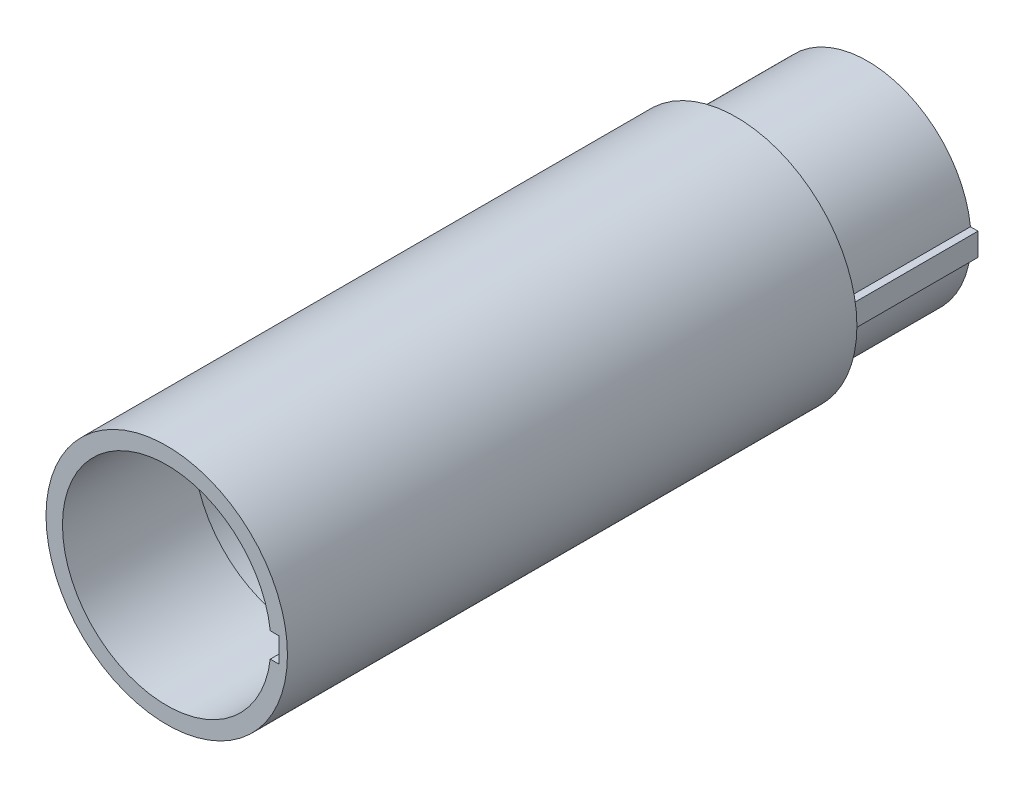
ISO-10303-21;
HEADER;
FILE_DESCRIPTION(('STEP AP214'),'2;1');
FILE_NAME('part.step','',(''),(''),'','','');
FILE_SCHEMA(('AUTOMOTIVE_DESIGN { 1 0 10303 214 1 1 1 1 }'));
ENDSEC;
DATA;
#1=APPLICATION_CONTEXT('core data for automotive mechanical design processes');
#2=APPLICATION_PROTOCOL_DEFINITION('international standard','automotive_design',2000,#1);
#3=PRODUCT_CONTEXT('',#1,'mechanical');
#4=PRODUCT('Part','Part','',(#3));
#5=PRODUCT_RELATED_PRODUCT_CATEGORY('part','',(#4));
#6=PRODUCT_DEFINITION_FORMATION('','',#4);
#7=PRODUCT_DEFINITION_CONTEXT('part definition',#1,'design');
#8=PRODUCT_DEFINITION('design','',#6,#7);
#9=PRODUCT_DEFINITION_SHAPE('','',#8);
#10=(LENGTH_UNIT() NAMED_UNIT(*) SI_UNIT(.MILLI.,.METRE.));
#11=(NAMED_UNIT(*) PLANE_ANGLE_UNIT() SI_UNIT($,.RADIAN.));
#12=(NAMED_UNIT(*) SI_UNIT($,.STERADIAN.) SOLID_ANGLE_UNIT());
#13=UNCERTAINTY_MEASURE_WITH_UNIT(LENGTH_MEASURE(1.E-05),#10,'distance_accuracy_value','');
#14=(GEOMETRIC_REPRESENTATION_CONTEXT(3) GLOBAL_UNCERTAINTY_ASSIGNED_CONTEXT((#13)) GLOBAL_UNIT_ASSIGNED_CONTEXT((#10,
#11,#12)) REPRESENTATION_CONTEXT('',''));
#15=CARTESIAN_POINT('',(0.,0.,0.));
#16=DIRECTION('',(0.,0.,1.));
#17=DIRECTION('',(1.,0.,0.));
#18=AXIS2_PLACEMENT_3D('',#15,#16,#17);
#19=CARTESIAN_POINT('',(0.,0.,-101.6));
#20=DIRECTION('',(0.,0.,1.));
#21=DIRECTION('',(1.,0.,0.));
#22=AXIS2_PLACEMENT_3D('',#19,#20,#21);
#23=CYLINDRICAL_SURFACE('',#22,12.7);
#24=CARTESIAN_POINT('',(0.,0.,-101.6));
#25=DIRECTION('',(0.,0.,1.));
#26=DIRECTION('',(1.,0.,0.));
#27=AXIS2_PLACEMENT_3D('',#24,#25,#26);
#28=CIRCLE('',#27,12.7);
#29=CARTESIAN_POINT('',(12.7,0.,-101.6));
#30=VERTEX_POINT('',#29);
#31=EDGE_CURVE('E173',#30,#30,#28,.T.);
#32=ORIENTED_EDGE('',*,*,#31,.F.);
#33=EDGE_LOOP('',(#32));
#34=FACE_BOUND('',#33,.T.);
#35=CARTESIAN_POINT('',(0.,0.,-76.2));
#36=DIRECTION('',(0.,0.,1.));
#37=DIRECTION('',(1.,0.,0.));
#38=AXIS2_PLACEMENT_3D('',#35,#36,#37);
#39=CIRCLE('',#38,12.7);
#40=CARTESIAN_POINT('',(12.7,0.,-76.2));
#41=VERTEX_POINT('',#40);
#42=EDGE_CURVE('E174',#41,#41,#39,.F.);
#43=ORIENTED_EDGE('',*,*,#42,.F.);
#44=EDGE_LOOP('',(#43));
#45=FACE_BOUND('',#44,.T.);
#46=ADVANCED_FACE('F33',(#34,#45),#23,.F.);
#47=CARTESIAN_POINT('',(0.,0.,-73.152));
#48=DIRECTION('',(0.,0.,1.));
#49=DIRECTION('',(1.,0.,0.));
#50=AXIS2_PLACEMENT_3D('',#47,#48,#49);
#51=CYLINDRICAL_SURFACE('',#50,15.113);
#52=CARTESIAN_POINT('',(0.,0.,-19.05));
#53=DIRECTION('',(0.,0.,-1.));
#54=DIRECTION('',(-1.,0.,0.));
#55=AXIS2_PLACEMENT_3D('',#52,#53,#54);
#56=CIRCLE('',#55,15.113);
#57=CARTESIAN_POINT('',(15.0080473413432,1.778,-19.05));
#58=VERTEX_POINT('',#57);
#59=CARTESIAN_POINT('',(15.0080473413432,-1.778,-19.05));
#60=VERTEX_POINT('',#59);
#61=EDGE_CURVE('E170',#58,#60,#56,.F.);
#62=ORIENTED_EDGE('',*,*,#61,.F.);
#63=DIRECTION('',(0.,0.,1.));
#64=VECTOR('',#63,1.);
#65=CARTESIAN_POINT('',(15.0080473413432,1.778,-73.152));
#66=LINE('',#65,#64);
#67=CARTESIAN_POINT('',(15.0080473413432,1.778,0.));
#68=VERTEX_POINT('',#67);
#69=EDGE_CURVE('E141',#58,#68,#66,.T.);
#70=ORIENTED_EDGE('',*,*,#69,.T.);
#71=CARTESIAN_POINT('',(0.,0.,0.));
#72=DIRECTION('',(0.,0.,1.));
#73=DIRECTION('',(1.,0.,0.));
#74=AXIS2_PLACEMENT_3D('',#71,#72,#73);
#75=CIRCLE('',#74,15.113);
#76=CARTESIAN_POINT('',(15.0080473413432,-1.778,0.));
#77=VERTEX_POINT('',#76);
#78=EDGE_CURVE('E171',#68,#77,#75,.T.);
#79=ORIENTED_EDGE('',*,*,#78,.T.);
#80=DIRECTION('',(0.,0.,1.));
#81=VECTOR('',#80,1.);
#82=CARTESIAN_POINT('',(15.0080473413432,-1.778,-73.152));
#83=LINE('',#82,#81);
#84=EDGE_CURVE('E116',#77,#60,#83,.F.);
#85=ORIENTED_EDGE('',*,*,#84,.T.);
#86=EDGE_LOOP('',(#62,#70,#79,#85));
#87=FACE_BOUND('',#86,.T.);
#88=ADVANCED_FACE('F250',(#87),#51,.F.);
#89=CARTESIAN_POINT('',(0.,0.,0.));
#90=DIRECTION('',(0.,0.,1.));
#91=DIRECTION('',(1.,0.,0.));
#92=AXIS2_PLACEMENT_3D('',#89,#90,#91);
#93=PLANE('',#92);
#94=DIRECTION('',(-1.,0.,0.));
#95=VECTOR('',#94,1.);
#96=CARTESIAN_POINT('',(12.7,1.778,0.));
#97=LINE('',#96,#95);
#98=CARTESIAN_POINT('',(16.256,1.778,0.));
#99=VERTEX_POINT('',#98);
#100=EDGE_CURVE('E128',#99,#68,#97,.T.);
#101=ORIENTED_EDGE('',*,*,#100,.F.);
#102=DIRECTION('',(0.,1.,0.));
#103=VECTOR('',#102,1.);
#104=CARTESIAN_POINT('',(16.256,1.778,0.));
#105=LINE('',#104,#103);
#106=CARTESIAN_POINT('',(16.256,-1.778,0.));
#107=VERTEX_POINT('',#106);
#108=EDGE_CURVE('E121',#107,#99,#105,.T.);
#109=ORIENTED_EDGE('',*,*,#108,.F.);
#110=DIRECTION('',(1.,0.,0.));
#111=VECTOR('',#110,1.);
#112=CARTESIAN_POINT('',(16.256,-1.778,0.));
#113=LINE('',#112,#111);
#114=EDGE_CURVE('E113',#77,#107,#113,.T.);
#115=ORIENTED_EDGE('',*,*,#114,.F.);
#116=ORIENTED_EDGE('',*,*,#78,.F.);
#117=EDGE_LOOP('',(#101,#109,#115,#116));
#118=FACE_BOUND('',#117,.T.);
#119=CARTESIAN_POINT('',(0.,0.,0.));
#120=DIRECTION('',(0.,0.,-1.));
#121=DIRECTION('',(-1.,0.,0.));
#122=AXIS2_PLACEMENT_3D('',#119,#120,#121);
#123=CIRCLE('',#122,17.5);
#124=CARTESIAN_POINT('',(-17.5,0.,0.));
#125=VERTEX_POINT('',#124);
#126=EDGE_CURVE('E177',#125,#125,#123,.T.);
#127=ORIENTED_EDGE('',*,*,#126,.F.);
#128=EDGE_LOOP('',(#127));
#129=FACE_BOUND('',#128,.T.);
#130=ADVANCED_FACE('F130',(#118,#129),#93,.T.);
#131=CARTESIAN_POINT('',(0.,0.,-101.6));
#132=DIRECTION('',(0.,0.,-1.));
#133=DIRECTION('',(-1.,0.,0.));
#134=AXIS2_PLACEMENT_3D('',#131,#132,#133);
#135=PLANE('',#134);
#136=ORIENTED_EDGE('',*,*,#31,.T.);
#137=EDGE_LOOP('',(#136));
#138=FACE_BOUND('',#137,.T.);
#139=DIRECTION('',(-1.,0.,0.));
#140=VECTOR('',#139,1.);
#141=CARTESIAN_POINT('',(12.7,-1.651,-101.6));
#142=LINE('',#141,#140);
#143=CARTESIAN_POINT('',(16.002,-1.651,-101.6));
#144=VERTEX_POINT('',#143);
#145=CARTESIAN_POINT('',(14.9088631021953,-1.651,-101.6));
#146=VERTEX_POINT('',#145);
#147=EDGE_CURVE('E153',#144,#146,#142,.T.);
#148=ORIENTED_EDGE('',*,*,#147,.T.);
#149=CARTESIAN_POINT('',(0.,0.,-101.6));
#150=DIRECTION('',(0.,0.,-1.));
#151=DIRECTION('',(-1.,0.,0.));
#152=AXIS2_PLACEMENT_3D('',#149,#150,#151);
#153=CIRCLE('',#152,15.);
#154=CARTESIAN_POINT('',(14.9088631021953,1.651,-101.6));
#155=VERTEX_POINT('',#154);
#156=EDGE_CURVE('E186',#146,#155,#153,.T.);
#157=ORIENTED_EDGE('',*,*,#156,.T.);
#158=DIRECTION('',(1.,0.,0.));
#159=VECTOR('',#158,1.);
#160=CARTESIAN_POINT('',(16.002,1.651,-101.6));
#161=LINE('',#160,#159);
#162=CARTESIAN_POINT('',(16.002,1.651,-101.6));
#163=VERTEX_POINT('',#162);
#164=EDGE_CURVE('E144',#155,#163,#161,.T.);
#165=ORIENTED_EDGE('',*,*,#164,.T.);
#166=DIRECTION('',(0.,-1.,0.));
#167=VECTOR('',#166,1.);
#168=CARTESIAN_POINT('',(16.002,-1.651,-101.6));
#169=LINE('',#168,#167);
#170=EDGE_CURVE('E150',#163,#144,#169,.T.);
#171=ORIENTED_EDGE('',*,*,#170,.T.);
#172=EDGE_LOOP('',(#148,#157,#165,#171));
#173=FACE_BOUND('',#172,.T.);
#174=ADVANCED_FACE('F267',(#138,#173),#135,.T.);
#175=CARTESIAN_POINT('',(0.,0.,-101.6));
#176=DIRECTION('',(0.,0.,-1.));
#177=DIRECTION('',(-1.,0.,0.));
#178=AXIS2_PLACEMENT_3D('',#175,#176,#177);
#179=CYLINDRICAL_SURFACE('',#178,15.);
#180=DIRECTION('',(0.,0.,-1.));
#181=VECTOR('',#180,1.);
#182=CARTESIAN_POINT('',(14.9088631021953,-1.651,-101.6));
#183=LINE('',#182,#181);
#184=CARTESIAN_POINT('',(14.9088631021953,-1.651,-82.55));
#185=VERTEX_POINT('',#184);
#186=EDGE_CURVE('E164',#185,#146,#183,.T.);
#187=ORIENTED_EDGE('',*,*,#186,.F.);
#188=CARTESIAN_POINT('',(0.,0.,-82.55));
#189=DIRECTION('',(0.,0.,-1.));
#190=DIRECTION('',(-1.,0.,0.));
#191=AXIS2_PLACEMENT_3D('',#188,#189,#190);
#192=CIRCLE('',#191,15.);
#193=CARTESIAN_POINT('',(14.9088631021953,1.651,-82.55));
#194=VERTEX_POINT('',#193);
#195=EDGE_CURVE('E183',#185,#194,#192,.T.);
#196=ORIENTED_EDGE('',*,*,#195,.T.);
#197=DIRECTION('',(0.,0.,-1.));
#198=VECTOR('',#197,1.);
#199=CARTESIAN_POINT('',(14.9088631021953,1.651,-101.6));
#200=LINE('',#199,#198);
#201=EDGE_CURVE('E161',#155,#194,#200,.F.);
#202=ORIENTED_EDGE('',*,*,#201,.F.);
#203=ORIENTED_EDGE('',*,*,#156,.F.);
#204=EDGE_LOOP('',(#187,#196,#202,#203));
#205=FACE_BOUND('',#204,.T.);
#206=ADVANCED_FACE('F263',(#205),#179,.T.);
#207=CARTESIAN_POINT('',(-15.,0.,-82.55));
#208=DIRECTION('',(0.,0.,-1.));
#209=DIRECTION('',(-1.,0.,0.));
#210=AXIS2_PLACEMENT_3D('',#207,#208,#209);
#211=PLANE('',#210);
#212=DIRECTION('',(-1.,0.,0.));
#213=VECTOR('',#212,1.);
#214=CARTESIAN_POINT('',(-15.,-1.651,-82.55));
#215=LINE('',#214,#213);
#216=CARTESIAN_POINT('',(16.002,-1.651,-82.55));
#217=VERTEX_POINT('',#216);
#218=EDGE_CURVE('E189',#217,#185,#215,.T.);
#219=ORIENTED_EDGE('',*,*,#218,.F.);
#220=DIRECTION('',(0.,1.,0.));
#221=VECTOR('',#220,1.);
#222=CARTESIAN_POINT('',(16.002,-1.651,-82.55));
#223=LINE('',#222,#221);
#224=CARTESIAN_POINT('',(16.002,1.651,-82.55));
#225=VERTEX_POINT('',#224);
#226=EDGE_CURVE('E145',#217,#225,#223,.T.);
#227=ORIENTED_EDGE('',*,*,#226,.T.);
#228=DIRECTION('',(-1.,0.,0.));
#229=VECTOR('',#228,1.);
#230=CARTESIAN_POINT('',(16.002,1.651,-82.55));
#231=LINE('',#230,#229);
#232=EDGE_CURVE('E147',#225,#194,#231,.T.);
#233=ORIENTED_EDGE('',*,*,#232,.T.);
#234=ORIENTED_EDGE('',*,*,#195,.F.);
#235=EDGE_LOOP('',(#219,#227,#233,#234));
#236=FACE_BOUND('',#235,.T.);
#237=CARTESIAN_POINT('',(0.,0.,-82.55));
#238=DIRECTION('',(0.,0.,-1.));
#239=DIRECTION('',(-1.,0.,0.));
#240=AXIS2_PLACEMENT_3D('',#237,#238,#239);
#241=CIRCLE('',#240,17.5);
#242=CARTESIAN_POINT('',(-17.5,0.,-82.55));
#243=VERTEX_POINT('',#242);
#244=EDGE_CURVE('E180',#243,#243,#241,.T.);
#245=ORIENTED_EDGE('',*,*,#244,.T.);
#246=EDGE_LOOP('',(#245));
#247=FACE_BOUND('',#246,.T.);
#248=ADVANCED_FACE('F259',(#236,#247),#211,.T.);
#249=CARTESIAN_POINT('',(0.,0.,-101.6));
#250=DIRECTION('',(0.,0.,-1.));
#251=DIRECTION('',(-1.,0.,0.));
#252=AXIS2_PLACEMENT_3D('',#249,#250,#251);
#253=CYLINDRICAL_SURFACE('',#252,17.5);
#254=ORIENTED_EDGE('',*,*,#126,.T.);
#255=EDGE_LOOP('',(#254));
#256=FACE_BOUND('',#255,.T.);
#257=ORIENTED_EDGE('',*,*,#244,.F.);
#258=EDGE_LOOP('',(#257));
#259=FACE_BOUND('',#258,.T.);
#260=ADVANCED_FACE('F242',(#256,#259),#253,.T.);
#261=CARTESIAN_POINT('',(15.875,0.,-76.2));
#262=DIRECTION('',(0.,0.,1.));
#263=DIRECTION('',(1.,0.,0.));
#264=AXIS2_PLACEMENT_3D('',#261,#262,#263);
#265=PLANE('',#264);
#266=CARTESIAN_POINT('',(0.,0.,-76.2));
#267=DIRECTION('',(0.,0.,1.));
#268=DIRECTION('',(1.,0.,0.));
#269=AXIS2_PLACEMENT_3D('',#266,#267,#268);
#270=CIRCLE('',#269,13.335);
#271=CARTESIAN_POINT('',(13.335,0.,-76.2));
#272=VERTEX_POINT('',#271);
#273=EDGE_CURVE('E203',#272,#272,#270,.T.);
#274=ORIENTED_EDGE('',*,*,#273,.T.);
#275=EDGE_LOOP('',(#274));
#276=FACE_BOUND('',#275,.T.);
#277=ORIENTED_EDGE('',*,*,#42,.T.);
#278=EDGE_LOOP('',(#277));
#279=FACE_BOUND('',#278,.T.);
#280=ADVANCED_FACE('F238',(#276,#279),#265,.T.);
#281=CARTESIAN_POINT('',(0.,0.,-19.05));
#282=DIRECTION('',(0.,0.,-1.));
#283=DIRECTION('',(-1.,0.,0.));
#284=AXIS2_PLACEMENT_3D('',#281,#282,#283);
#285=PLANE('',#284);
#286=DIRECTION('',(1.,0.,0.));
#287=VECTOR('',#286,1.);
#288=CARTESIAN_POINT('',(0.,1.778,-19.05));
#289=LINE('',#288,#287);
#290=CARTESIAN_POINT('',(15.7751177808598,1.778,-19.05));
#291=VERTEX_POINT('',#290);
#292=EDGE_CURVE('E139',#58,#291,#289,.T.);
#293=ORIENTED_EDGE('',*,*,#292,.F.);
#294=ORIENTED_EDGE('',*,*,#61,.T.);
#295=DIRECTION('',(-1.,0.,0.));
#296=VECTOR('',#295,1.);
#297=CARTESIAN_POINT('',(0.,-1.778,-19.05));
#298=LINE('',#297,#296);
#299=CARTESIAN_POINT('',(15.7751177808598,-1.778,-19.05));
#300=VERTEX_POINT('',#299);
#301=EDGE_CURVE('E135',#300,#60,#298,.T.);
#302=ORIENTED_EDGE('',*,*,#301,.F.);
#303=CARTESIAN_POINT('',(0.,0.,-19.05));
#304=DIRECTION('',(0.,0.,-1.));
#305=DIRECTION('',(-1.,0.,0.));
#306=AXIS2_PLACEMENT_3D('',#303,#304,#305);
#307=CIRCLE('',#306,15.875);
#308=EDGE_CURVE('E167',#300,#291,#307,.T.);
#309=ORIENTED_EDGE('',*,*,#308,.T.);
#310=EDGE_LOOP('',(#293,#294,#302,#309));
#311=FACE_BOUND('',#310,.T.);
#312=ADVANCED_FACE('F241',(#311),#285,.T.);
#313=CARTESIAN_POINT('',(0.,0.,-76.2));
#314=DIRECTION('',(0.,0.,-1.));
#315=DIRECTION('',(-1.,0.,0.));
#316=AXIS2_PLACEMENT_3D('',#313,#314,#315);
#317=CYLINDRICAL_SURFACE('',#316,15.875);
#318=CARTESIAN_POINT('',(0.,0.,-69.221407354585));
#319=DIRECTION('',(0.,0.,1.));
#320=DIRECTION('',(1.,0.,0.));
#321=AXIS2_PLACEMENT_3D('',#318,#319,#320);
#322=CIRCLE('',#321,15.875);
#323=CARTESIAN_POINT('',(15.875,0.,-69.221407354585));
#324=VERTEX_POINT('',#323);
#325=EDGE_CURVE('E200',#324,#324,#322,.F.);
#326=ORIENTED_EDGE('',*,*,#325,.T.);
#327=EDGE_LOOP('',(#326));
#328=FACE_BOUND('',#327,.T.);
#329=DIRECTION('',(0.,0.,-1.));
#330=VECTOR('',#329,1.);
#331=CARTESIAN_POINT('',(15.7751177808598,-1.778,-76.2));
#332=LINE('',#331,#330);
#333=CARTESIAN_POINT('',(15.7751177808598,-1.778,-22.352));
#334=VERTEX_POINT('',#333);
#335=EDGE_CURVE('E196',#334,#300,#332,.F.);
#336=ORIENTED_EDGE('',*,*,#335,.F.);
#337=CARTESIAN_POINT('',(0.,0.,-22.352));
#338=DIRECTION('',(0.,0.,-1.));
#339=DIRECTION('',(-1.,0.,0.));
#340=AXIS2_PLACEMENT_3D('',#337,#338,#339);
#341=CIRCLE('',#340,15.875);
#342=CARTESIAN_POINT('',(15.7751177808598,1.778,-22.352));
#343=VERTEX_POINT('',#342);
#344=EDGE_CURVE('E206',#334,#343,#341,.F.);
#345=ORIENTED_EDGE('',*,*,#344,.T.);
#346=DIRECTION('',(0.,0.,-1.));
#347=VECTOR('',#346,1.);
#348=CARTESIAN_POINT('',(15.7751177808598,1.778,-76.2));
#349=LINE('',#348,#347);
#350=EDGE_CURVE('E198',#291,#343,#349,.T.);
#351=ORIENTED_EDGE('',*,*,#350,.F.);
#352=ORIENTED_EDGE('',*,*,#308,.F.);
#353=EDGE_LOOP('',(#336,#345,#351,#352));
#354=FACE_BOUND('',#353,.T.);
#355=ADVANCED_FACE('F229',(#328,#354),#317,.F.);
#356=CARTESIAN_POINT('',(12.7,-1.651,-77.880266817044));
#357=DIRECTION('',(0.,-1.,0.));
#358=DIRECTION('',(1.,0.,0.));
#359=AXIS2_PLACEMENT_3D('',#356,#357,#358);
#360=PLANE('',#359);
#361=ORIENTED_EDGE('',*,*,#218,.T.);
#362=ORIENTED_EDGE('',*,*,#186,.T.);
#363=ORIENTED_EDGE('',*,*,#147,.F.);
#364=DIRECTION('',(0.,0.,-1.));
#365=VECTOR('',#364,1.);
#366=CARTESIAN_POINT('',(16.002,-1.651,-77.880266817044));
#367=LINE('',#366,#365);
#368=EDGE_CURVE('E148',#217,#144,#367,.T.);
#369=ORIENTED_EDGE('',*,*,#368,.F.);
#370=EDGE_LOOP('',(#361,#362,#363,#369));
#371=FACE_BOUND('',#370,.T.);
#372=ADVANCED_FACE('F225',(#371),#360,.T.);
#373=CARTESIAN_POINT('',(16.002,-1.651,-77.880266817044));
#374=DIRECTION('',(1.,0.,0.));
#375=DIRECTION('',(0.,0.,-1.));
#376=AXIS2_PLACEMENT_3D('',#373,#374,#375);
#377=PLANE('',#376);
#378=ORIENTED_EDGE('',*,*,#226,.F.);
#379=ORIENTED_EDGE('',*,*,#368,.T.);
#380=ORIENTED_EDGE('',*,*,#170,.F.);
#381=DIRECTION('',(0.,0.,-1.));
#382=VECTOR('',#381,1.);
#383=CARTESIAN_POINT('',(16.002,1.651,-77.880266817044));
#384=LINE('',#383,#382);
#385=EDGE_CURVE('E156',#225,#163,#384,.T.);
#386=ORIENTED_EDGE('',*,*,#385,.F.);
#387=EDGE_LOOP('',(#378,#379,#380,#386));
#388=FACE_BOUND('',#387,.T.);
#389=ADVANCED_FACE('F228',(#388),#377,.T.);
#390=CARTESIAN_POINT('',(16.002,1.651,-77.880266817044));
#391=DIRECTION('',(0.,1.,0.));
#392=DIRECTION('',(-1.,0.,0.));
#393=AXIS2_PLACEMENT_3D('',#390,#391,#392);
#394=PLANE('',#393);
#395=ORIENTED_EDGE('',*,*,#164,.F.);
#396=ORIENTED_EDGE('',*,*,#201,.T.);
#397=ORIENTED_EDGE('',*,*,#232,.F.);
#398=ORIENTED_EDGE('',*,*,#385,.T.);
#399=EDGE_LOOP('',(#395,#396,#397,#398));
#400=FACE_BOUND('',#399,.T.);
#401=ADVANCED_FACE('F233',(#400),#394,.T.);
#402=CARTESIAN_POINT('',(12.7,1.778,-19.812));
#403=DIRECTION('',(0.,1.,0.));
#404=DIRECTION('',(0.,0.,1.));
#405=AXIS2_PLACEMENT_3D('',#402,#403,#404);
#406=PLANE('',#405);
#407=ORIENTED_EDGE('',*,*,#292,.T.);
#408=ORIENTED_EDGE('',*,*,#350,.T.);
#409=CARTESIAN_POINT('',(15.7751177808598,1.778,-22.352));
#410=CARTESIAN_POINT('',(15.8552720987104,1.778,-22.2723497759877));
#411=CARTESIAN_POINT('',(15.9354227758986,1.778,-22.1926958889415));
#412=CARTESIAN_POINT('',(16.0957168489453,1.778,-22.0333807887865));
#413=CARTESIAN_POINT('',(16.1758602448039,1.778,-21.9537195756777));
#414=CARTESIAN_POINT('',(16.256,1.778,-21.874054699535));
#415=B_SPLINE_CURVE_WITH_KNOTS('',3,(#409,#410,#411,#412,#413,#414),.UNSPECIFIED.,.F.,.F.,(4,2,
4),(0.,0.338998311172198,0.677996622323394),.UNSPECIFIED.);
#416=CARTESIAN_POINT('',(16.256,1.778,-21.874054699535));
#417=VERTEX_POINT('',#416);
#418=EDGE_CURVE('E11',#343,#417,#415,.T.);
#419=ORIENTED_EDGE('',*,*,#418,.T.);
#420=DIRECTION('',(0.,0.,1.));
#421=VECTOR('',#420,1.);
#422=CARTESIAN_POINT('',(16.256,1.778,-19.812));
#423=LINE('',#422,#421);
#424=EDGE_CURVE('E53',#417,#99,#423,.T.);
#425=ORIENTED_EDGE('',*,*,#424,.T.);
#426=ORIENTED_EDGE('',*,*,#100,.T.);
#427=ORIENTED_EDGE('',*,*,#69,.F.);
#428=EDGE_LOOP('',(#407,#408,#419,#425,#426,#427));
#429=FACE_BOUND('',#428,.T.);
#430=ADVANCED_FACE('F220',(#429),#406,.F.);
#431=CARTESIAN_POINT('',(16.256,-1.778,-19.812));
#432=DIRECTION('',(0.,-1.,0.));
#433=DIRECTION('',(1.,0.,0.));
#434=AXIS2_PLACEMENT_3D('',#431,#432,#433);
#435=PLANE('',#434);
#436=ORIENTED_EDGE('',*,*,#114,.T.);
#437=DIRECTION('',(0.,0.,1.));
#438=VECTOR('',#437,1.);
#439=CARTESIAN_POINT('',(16.256,-1.778,-19.812));
#440=LINE('',#439,#438);
#441=CARTESIAN_POINT('',(16.256,-1.778,-21.874054699535));
#442=VERTEX_POINT('',#441);
#443=EDGE_CURVE('E60',#442,#107,#440,.T.);
#444=ORIENTED_EDGE('',*,*,#443,.F.);
#445=CARTESIAN_POINT('',(16.256,-1.778,-21.874054699535));
#446=CARTESIAN_POINT('',(16.1758602448038,-1.778,-21.9537195756777));
#447=CARTESIAN_POINT('',(16.0957168489453,-1.778,-22.0333807887865));
#448=CARTESIAN_POINT('',(15.9354227758986,-1.778,-22.1926958889415));
#449=CARTESIAN_POINT('',(15.8552720987104,-1.778,-22.2723497759877));
#450=CARTESIAN_POINT('',(15.7751177808598,-1.778,-22.352));
#451=B_SPLINE_CURVE_WITH_KNOTS('',3,(#445,#446,#447,#448,#449,#450),.UNSPECIFIED.,.F.,.F.,(4,2,
4),(0.,0.338998311151194,0.677996622323392),.UNSPECIFIED.);
#452=EDGE_CURVE('E46',#442,#334,#451,.T.);
#453=ORIENTED_EDGE('',*,*,#452,.T.);
#454=ORIENTED_EDGE('',*,*,#335,.T.);
#455=ORIENTED_EDGE('',*,*,#301,.T.);
#456=ORIENTED_EDGE('',*,*,#84,.F.);
#457=EDGE_LOOP('',(#436,#444,#453,#454,#455,#456));
#458=FACE_BOUND('',#457,.T.);
#459=ADVANCED_FACE('F114',(#458),#435,.F.);
#460=CARTESIAN_POINT('',(16.256,1.778,-19.812));
#461=DIRECTION('',(1.,0.,0.));
#462=DIRECTION('',(0.,0.,-1.));
#463=AXIS2_PLACEMENT_3D('',#460,#461,#462);
#464=PLANE('',#463);
#465=ORIENTED_EDGE('',*,*,#108,.T.);
#466=ORIENTED_EDGE('',*,*,#424,.F.);
#467=CARTESIAN_POINT('',(16.256,1.778,-21.874054699535));
#468=CARTESIAN_POINT('',(16.256,1.48239780283544,-21.9062495682344));
#469=CARTESIAN_POINT('',(16.256,1.18591680335895,-21.9305100537835));
#470=CARTESIAN_POINT('',(16.256,0.592955474946374,-21.9628614641875));
#471=CARTESIAN_POINT('',(16.256,0.296477737473187,-21.971));
#472=CARTESIAN_POINT('',(16.256,-0.296477737473187,-21.971));
#473=CARTESIAN_POINT('',(16.256,-0.592955474946374,-21.9628614641875));
#474=CARTESIAN_POINT('',(16.256,-1.18591680335895,-21.9305100537835));
#475=CARTESIAN_POINT('',(16.256,-1.48239780283544,-21.9062495682344));
#476=CARTESIAN_POINT('',(16.256,-1.778,-21.874054699535));
#477=B_SPLINE_CURVE_WITH_KNOTS('',3,(#467,#468,#469,#470,#471,#472,#473,#474,#475,#476),
.UNSPECIFIED.,.F.,.F.,(4,2,2,2,4),(0.,0.891966922151464,1.78129575842682,2.67062459470218,
3.56259151685364),.UNSPECIFIED.);
#478=EDGE_CURVE('E126',#417,#442,#477,.T.);
#479=ORIENTED_EDGE('',*,*,#478,.T.);
#480=ORIENTED_EDGE('',*,*,#443,.T.);
#481=EDGE_LOOP('',(#465,#466,#479,#480));
#482=FACE_BOUND('',#481,.T.);
#483=ADVANCED_FACE('F123',(#482),#464,.F.);
#484=CARTESIAN_POINT('',(0.,0.,-69.221407354585));
#485=DIRECTION('',(0.,0.,1.));
#486=DIRECTION('',(1.,0.,0.));
#487=AXIS2_PLACEMENT_3D('',#484,#485,#486);
#488=CONICAL_SURFACE('',#487,15.875,0.349065850398858);
#489=ORIENTED_EDGE('',*,*,#273,.F.);
#490=EDGE_LOOP('',(#489));
#491=FACE_BOUND('',#490,.T.);
#492=ORIENTED_EDGE('',*,*,#325,.F.);
#493=EDGE_LOOP('',(#492));
#494=FACE_BOUND('',#493,.T.);
#495=ADVANCED_FACE('F219',(#491,#494),#488,.F.);
#496=CARTESIAN_POINT('',(0.,0.,-19.812));
#497=DIRECTION('',(0.,0.,1.));
#498=DIRECTION('',(1.,0.,0.));
#499=AXIS2_PLACEMENT_3D('',#496,#497,#498);
#500=CONICAL_SURFACE('',#499,18.415,0.785398163397452);
#501=ORIENTED_EDGE('',*,*,#418,.F.);
#502=ORIENTED_EDGE('',*,*,#344,.F.);
#503=ORIENTED_EDGE('',*,*,#452,.F.);
#504=ORIENTED_EDGE('',*,*,#478,.F.);
#505=EDGE_LOOP('',(#501,#502,#503,#504));
#506=FACE_BOUND('',#505,.T.);
#507=ADVANCED_FACE('F35',(#506),#500,.F.);
#508=CLOSED_SHELL('',(#46,#88,#130,#174,#206,#248,#260,#280,#312,#355,#372,#389,#401,#430,#459,
#483,#495,#507));
#509=MANIFOLD_SOLID_BREP('B2',#508);
#510=ADVANCED_BREP_SHAPE_REPRESENTATION('',(#18,#509),#14);
#511=SHAPE_DEFINITION_REPRESENTATION(#9,#510);
ENDSEC;
END-ISO-10303-21;
